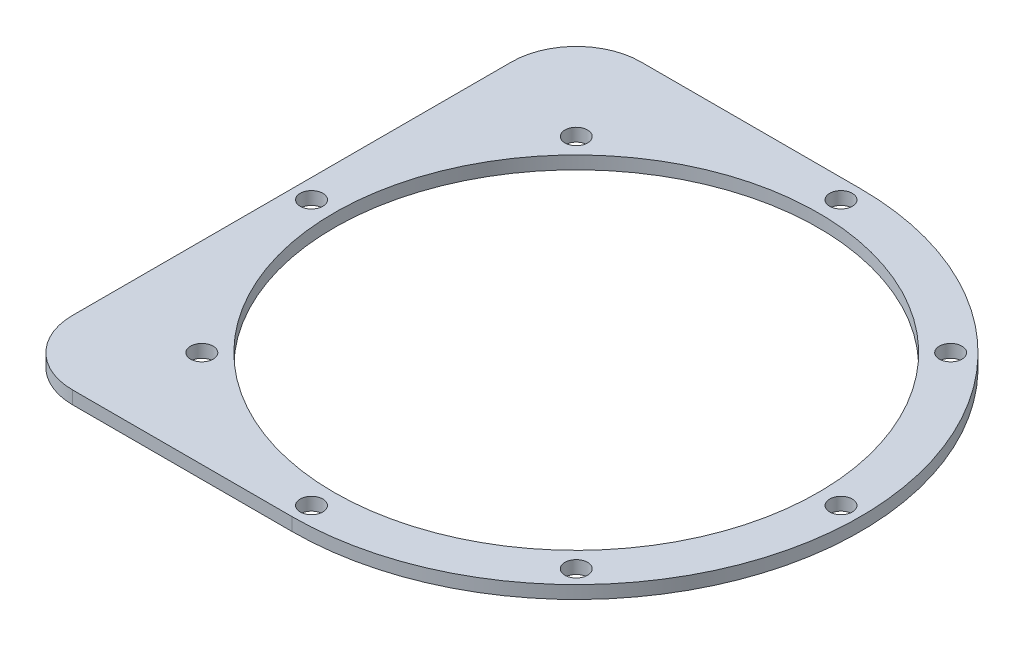
ISO-10303-21;
HEADER;
FILE_DESCRIPTION(('STEP AP214'),'2;1');
FILE_NAME('part.step','',(''),(''),'','','');
FILE_SCHEMA(('AUTOMOTIVE_DESIGN { 1 0 10303 214 1 1 1 1 }'));
ENDSEC;
DATA;
#1=APPLICATION_CONTEXT('core data for automotive mechanical design processes');
#2=APPLICATION_PROTOCOL_DEFINITION('international standard','automotive_design',2000,#1);
#3=PRODUCT_CONTEXT('',#1,'mechanical');
#4=PRODUCT('Part','Part','',(#3));
#5=PRODUCT_RELATED_PRODUCT_CATEGORY('part','',(#4));
#6=PRODUCT_DEFINITION_FORMATION('','',#4);
#7=PRODUCT_DEFINITION_CONTEXT('part definition',#1,'design');
#8=PRODUCT_DEFINITION('design','',#6,#7);
#9=PRODUCT_DEFINITION_SHAPE('','',#8);
#10=(LENGTH_UNIT() NAMED_UNIT(*) SI_UNIT(.MILLI.,.METRE.));
#11=(NAMED_UNIT(*) PLANE_ANGLE_UNIT() SI_UNIT($,.RADIAN.));
#12=(NAMED_UNIT(*) SI_UNIT($,.STERADIAN.) SOLID_ANGLE_UNIT());
#13=UNCERTAINTY_MEASURE_WITH_UNIT(LENGTH_MEASURE(1.E-05),#10,'distance_accuracy_value','');
#14=(GEOMETRIC_REPRESENTATION_CONTEXT(3) GLOBAL_UNCERTAINTY_ASSIGNED_CONTEXT((#13)) GLOBAL_UNIT_ASSIGNED_CONTEXT((#10,
#11,#12)) REPRESENTATION_CONTEXT('',''));
#15=CARTESIAN_POINT('',(0.,0.,0.));
#16=DIRECTION('',(0.,0.,1.));
#17=DIRECTION('',(1.,0.,0.));
#18=AXIS2_PLACEMENT_3D('',#15,#16,#17);
#19=CARTESIAN_POINT('',(0.,2.,0.));
#20=DIRECTION('',(0.,-1.,0.));
#21=DIRECTION('',(0.,0.,-1.));
#22=AXIS2_PLACEMENT_3D('',#19,#20,#21);
#23=CYLINDRICAL_SURFACE('',#22,44.);
#24=CARTESIAN_POINT('',(0.,0.,0.));
#25=DIRECTION('',(0.,1.,0.));
#26=DIRECTION('',(0.,0.,1.));
#27=AXIS2_PLACEMENT_3D('',#24,#25,#26);
#28=CIRCLE('',#27,44.);
#29=CARTESIAN_POINT('',(0.,0.,44.));
#30=VERTEX_POINT('',#29);
#31=CARTESIAN_POINT('',(0.,0.,-44.));
#32=VERTEX_POINT('',#31);
#33=EDGE_CURVE('E92',#30,#32,#28,.T.);
#34=ORIENTED_EDGE('',*,*,#33,.T.);
#35=DIRECTION('',(0.,1.,0.));
#36=VECTOR('',#35,1.);
#37=CARTESIAN_POINT('',(0.,-98.3869910099907,-44.));
#38=LINE('',#37,#36);
#39=CARTESIAN_POINT('',(0.,2.,-44.));
#40=VERTEX_POINT('',#39);
#41=EDGE_CURVE('E106',#32,#40,#38,.T.);
#42=ORIENTED_EDGE('',*,*,#41,.T.);
#43=CARTESIAN_POINT('',(0.,2.,0.));
#44=DIRECTION('',(0.,1.,0.));
#45=DIRECTION('',(0.,0.,1.));
#46=AXIS2_PLACEMENT_3D('',#43,#44,#45);
#47=CIRCLE('',#46,44.);
#48=CARTESIAN_POINT('',(0.,2.,44.));
#49=VERTEX_POINT('',#48);
#50=EDGE_CURVE('E100',#49,#40,#47,.T.);
#51=ORIENTED_EDGE('',*,*,#50,.F.);
#52=DIRECTION('',(0.,1.,0.));
#53=VECTOR('',#52,1.);
#54=CARTESIAN_POINT('',(0.,-98.3869910099907,44.));
#55=LINE('',#54,#53);
#56=EDGE_CURVE('E104',#30,#49,#55,.T.);
#57=ORIENTED_EDGE('',*,*,#56,.F.);
#58=EDGE_LOOP('',(#34,#42,#51,#57));
#59=FACE_BOUND('',#58,.T.);
#60=ADVANCED_FACE('F38',(#59),#23,.T.);
#61=CARTESIAN_POINT('',(0.,2.,0.));
#62=DIRECTION('',(0.,1.,0.));
#63=DIRECTION('',(0.,0.,1.));
#64=AXIS2_PLACEMENT_3D('',#61,#62,#63);
#65=PLANE('',#64);
#66=CARTESIAN_POINT('',(0.,2.,0.));
#67=DIRECTION('',(0.,1.,0.));
#68=DIRECTION('',(0.,0.,1.));
#69=AXIS2_PLACEMENT_3D('',#66,#67,#68);
#70=CIRCLE('',#69,37.5);
#71=CARTESIAN_POINT('',(0.,2.,37.5));
#72=VERTEX_POINT('',#71);
#73=EDGE_CURVE('E194',#72,#72,#70,.T.);
#74=ORIENTED_EDGE('',*,*,#73,.F.);
#75=EDGE_LOOP('',(#74));
#76=FACE_BOUND('',#75,.T.);
#77=CARTESIAN_POINT('',(-1.43150734892568E-13,2.,-41.));
#78=DIRECTION('',(0.,1.,0.));
#79=DIRECTION('',(1.,0.,0.));
#80=AXIS2_PLACEMENT_3D('',#77,#78,#79);
#81=CIRCLE('',#80,1.75);
#82=CARTESIAN_POINT('',(1.74999999999986,2.,-41.));
#83=VERTEX_POINT('',#82);
#84=EDGE_CURVE('E177',#83,#83,#81,.T.);
#85=ORIENTED_EDGE('',*,*,#84,.F.);
#86=EDGE_LOOP('',(#85));
#87=FACE_BOUND('',#86,.T.);
#88=CARTESIAN_POINT('',(-28.9913780286486,2.,-28.9913780286483));
#89=DIRECTION('',(0.,1.,0.));
#90=DIRECTION('',(0.707106781186544,0.,-0.707106781186551));
#91=AXIS2_PLACEMENT_3D('',#88,#89,#90);
#92=CIRCLE('',#91,1.75);
#93=CARTESIAN_POINT('',(-27.7539411615722,2.,-30.2288148957248));
#94=VERTEX_POINT('',#93);
#95=EDGE_CURVE('E171',#94,#94,#92,.T.);
#96=ORIENTED_EDGE('',*,*,#95,.F.);
#97=EDGE_LOOP('',(#96));
#98=FACE_BOUND('',#97,.T.);
#99=CARTESIAN_POINT('',(-41.,2.,0.));
#100=DIRECTION('',(0.,1.,0.));
#101=DIRECTION('',(0.,0.,-1.));
#102=AXIS2_PLACEMENT_3D('',#99,#100,#101);
#103=CIRCLE('',#102,1.75);
#104=CARTESIAN_POINT('',(-41.,2.,-1.75));
#105=VERTEX_POINT('',#104);
#106=EDGE_CURVE('E165',#105,#105,#103,.T.);
#107=ORIENTED_EDGE('',*,*,#106,.F.);
#108=EDGE_LOOP('',(#107));
#109=FACE_BOUND('',#108,.T.);
#110=CARTESIAN_POINT('',(-28.9913780286482,2.,28.9913780286487));
#111=DIRECTION('',(0.,1.,0.));
#112=DIRECTION('',(-0.707106781186554,0.,-0.707106781186541));
#113=AXIS2_PLACEMENT_3D('',#110,#111,#112);
#114=CIRCLE('',#113,1.75);
#115=CARTESIAN_POINT('',(-30.2288148957247,2.,27.7539411615723));
#116=VERTEX_POINT('',#115);
#117=EDGE_CURVE('E158',#116,#116,#114,.T.);
#118=ORIENTED_EDGE('',*,*,#117,.F.);
#119=EDGE_LOOP('',(#118));
#120=FACE_BOUND('',#119,.T.);
#121=CARTESIAN_POINT('',(4.29452204677705E-13,2.,41.));
#122=DIRECTION('',(0.,1.,0.));
#123=DIRECTION('',(-1.,0.,0.));
#124=AXIS2_PLACEMENT_3D('',#121,#122,#123);
#125=CIRCLE('',#124,1.75);
#126=CARTESIAN_POINT('',(-1.74999999999957,2.,41.));
#127=VERTEX_POINT('',#126);
#128=EDGE_CURVE('E189',#127,#127,#125,.T.);
#129=ORIENTED_EDGE('',*,*,#128,.F.);
#130=EDGE_LOOP('',(#129));
#131=FACE_BOUND('',#130,.T.);
#132=CARTESIAN_POINT('',(28.9913780286488,2.,28.9913780286481));
#133=DIRECTION('',(0.,1.,0.));
#134=DIRECTION('',(-0.707106781186539,0.,0.707106781186556));
#135=AXIS2_PLACEMENT_3D('',#132,#133,#134);
#136=CIRCLE('',#135,1.75);
#137=CARTESIAN_POINT('',(27.7539411615724,2.,30.2288148957246));
#138=VERTEX_POINT('',#137);
#139=EDGE_CURVE('E182',#138,#138,#136,.T.);
#140=ORIENTED_EDGE('',*,*,#139,.F.);
#141=EDGE_LOOP('',(#140));
#142=FACE_BOUND('',#141,.T.);
#143=CARTESIAN_POINT('',(28.9913780286484,2.,-28.9913780286485));
#144=DIRECTION('',(0.,1.,0.));
#145=DIRECTION('',(0.707106781186549,0.,0.707106781186546));
#146=AXIS2_PLACEMENT_3D('',#143,#144,#145);
#147=CIRCLE('',#146,1.75);
#148=CARTESIAN_POINT('',(30.2288148957249,2.,-27.753941161572));
#149=VERTEX_POINT('',#148);
#150=EDGE_CURVE('E152',#149,#149,#147,.T.);
#151=ORIENTED_EDGE('',*,*,#150,.F.);
#152=EDGE_LOOP('',(#151));
#153=FACE_BOUND('',#152,.T.);
#154=CARTESIAN_POINT('',(41.,2.,0.));
#155=DIRECTION('',(0.,1.,0.));
#156=DIRECTION('',(0.,0.,1.));
#157=AXIS2_PLACEMENT_3D('',#154,#155,#156);
#158=CIRCLE('',#157,1.75);
#159=CARTESIAN_POINT('',(41.,2.,1.75));
#160=VERTEX_POINT('',#159);
#161=EDGE_CURVE('E146',#160,#160,#158,.T.);
#162=ORIENTED_EDGE('',*,*,#161,.F.);
#163=EDGE_LOOP('',(#162));
#164=FACE_BOUND('',#163,.T.);
#165=DIRECTION('',(0.,0.,1.));
#166=VECTOR('',#165,1.);
#167=CARTESIAN_POINT('',(-44.,2.,44.));
#168=LINE('',#167,#166);
#169=CARTESIAN_POINT('',(-44.,2.,-34.));
#170=VERTEX_POINT('',#169);
#171=CARTESIAN_POINT('',(-44.,2.,34.));
#172=VERTEX_POINT('',#171);
#173=EDGE_CURVE('E138',#170,#172,#168,.T.);
#174=ORIENTED_EDGE('',*,*,#173,.T.);
#175=CARTESIAN_POINT('',(-34.,2.,34.));
#176=DIRECTION('',(0.,1.,0.));
#177=DIRECTION('',(0.,0.,1.));
#178=AXIS2_PLACEMENT_3D('',#175,#176,#177);
#179=CIRCLE('',#178,10.);
#180=CARTESIAN_POINT('',(-34.,2.,44.));
#181=VERTEX_POINT('',#180);
#182=EDGE_CURVE('E123',#172,#181,#179,.T.);
#183=ORIENTED_EDGE('',*,*,#182,.T.);
#184=DIRECTION('',(1.,0.,0.));
#185=VECTOR('',#184,1.);
#186=CARTESIAN_POINT('',(0.,2.,44.));
#187=LINE('',#186,#185);
#188=EDGE_CURVE('E137',#181,#49,#187,.T.);
#189=ORIENTED_EDGE('',*,*,#188,.T.);
#190=ORIENTED_EDGE('',*,*,#50,.T.);
#191=DIRECTION('',(-1.,0.,0.));
#192=VECTOR('',#191,1.);
#193=CARTESIAN_POINT('',(0.,2.,-44.));
#194=LINE('',#193,#192);
#195=CARTESIAN_POINT('',(-34.,2.,-44.));
#196=VERTEX_POINT('',#195);
#197=EDGE_CURVE('E107',#40,#196,#194,.T.);
#198=ORIENTED_EDGE('',*,*,#197,.T.);
#199=CARTESIAN_POINT('',(-34.,2.,-34.));
#200=DIRECTION('',(0.,1.,0.));
#201=DIRECTION('',(0.,0.,1.));
#202=AXIS2_PLACEMENT_3D('',#199,#200,#201);
#203=CIRCLE('',#202,10.);
#204=EDGE_CURVE('E121',#196,#170,#203,.T.);
#205=ORIENTED_EDGE('',*,*,#204,.T.);
#206=EDGE_LOOP('',(#174,#183,#189,#190,#198,#205));
#207=FACE_BOUND('',#206,.T.);
#208=ADVANCED_FACE('F136',(#76,#87,#98,#109,#120,#131,#142,#153,#164,#207),#65,.T.);
#209=CARTESIAN_POINT('',(0.,0.,0.));
#210=DIRECTION('',(0.,1.,0.));
#211=DIRECTION('',(0.,0.,1.));
#212=AXIS2_PLACEMENT_3D('',#209,#210,#211);
#213=PLANE('',#212);
#214=CARTESIAN_POINT('',(0.,0.,0.));
#215=DIRECTION('',(0.,1.,0.));
#216=DIRECTION('',(0.,0.,1.));
#217=AXIS2_PLACEMENT_3D('',#214,#215,#216);
#218=CIRCLE('',#217,37.5);
#219=CARTESIAN_POINT('',(0.,0.,37.5));
#220=VERTEX_POINT('',#219);
#221=EDGE_CURVE('E186',#220,#220,#218,.T.);
#222=ORIENTED_EDGE('',*,*,#221,.T.);
#223=EDGE_LOOP('',(#222));
#224=FACE_BOUND('',#223,.T.);
#225=CARTESIAN_POINT('',(-1.43150734892568E-13,0.,-41.));
#226=DIRECTION('',(0.,1.,0.));
#227=DIRECTION('',(1.,0.,0.));
#228=AXIS2_PLACEMENT_3D('',#225,#226,#227);
#229=CIRCLE('',#228,1.75);
#230=CARTESIAN_POINT('',(1.74999999999986,0.,-41.));
#231=VERTEX_POINT('',#230);
#232=EDGE_CURVE('E155',#231,#231,#229,.T.);
#233=ORIENTED_EDGE('',*,*,#232,.T.);
#234=EDGE_LOOP('',(#233));
#235=FACE_BOUND('',#234,.T.);
#236=CARTESIAN_POINT('',(-28.9913780286486,0.,-28.9913780286483));
#237=DIRECTION('',(0.,1.,0.));
#238=DIRECTION('',(0.707106781186544,0.,-0.707106781186551));
#239=AXIS2_PLACEMENT_3D('',#236,#237,#238);
#240=CIRCLE('',#239,1.75);
#241=CARTESIAN_POINT('',(-27.7539411615722,0.,-30.2288148957248));
#242=VERTEX_POINT('',#241);
#243=EDGE_CURVE('E174',#242,#242,#240,.T.);
#244=ORIENTED_EDGE('',*,*,#243,.T.);
#245=EDGE_LOOP('',(#244));
#246=FACE_BOUND('',#245,.T.);
#247=CARTESIAN_POINT('',(-41.,0.,0.));
#248=DIRECTION('',(0.,1.,0.));
#249=DIRECTION('',(0.,0.,-1.));
#250=AXIS2_PLACEMENT_3D('',#247,#248,#249);
#251=CIRCLE('',#250,1.75);
#252=CARTESIAN_POINT('',(-41.,0.,-1.75));
#253=VERTEX_POINT('',#252);
#254=EDGE_CURVE('E168',#253,#253,#251,.T.);
#255=ORIENTED_EDGE('',*,*,#254,.T.);
#256=EDGE_LOOP('',(#255));
#257=FACE_BOUND('',#256,.T.);
#258=CARTESIAN_POINT('',(-28.9913780286482,0.,28.9913780286487));
#259=DIRECTION('',(0.,1.,0.));
#260=DIRECTION('',(-0.707106781186554,0.,-0.707106781186541));
#261=AXIS2_PLACEMENT_3D('',#258,#259,#260);
#262=CIRCLE('',#261,1.75);
#263=CARTESIAN_POINT('',(-30.2288148957247,0.,27.7539411615723));
#264=VERTEX_POINT('',#263);
#265=EDGE_CURVE('E161',#264,#264,#262,.T.);
#266=ORIENTED_EDGE('',*,*,#265,.T.);
#267=EDGE_LOOP('',(#266));
#268=FACE_BOUND('',#267,.T.);
#269=CARTESIAN_POINT('',(4.29452204677705E-13,0.,41.));
#270=DIRECTION('',(0.,1.,0.));
#271=DIRECTION('',(-1.,0.,0.));
#272=AXIS2_PLACEMENT_3D('',#269,#270,#271);
#273=CIRCLE('',#272,1.75);
#274=CARTESIAN_POINT('',(-1.74999999999957,0.,41.));
#275=VERTEX_POINT('',#274);
#276=EDGE_CURVE('E162',#275,#275,#273,.T.);
#277=ORIENTED_EDGE('',*,*,#276,.T.);
#278=EDGE_LOOP('',(#277));
#279=FACE_BOUND('',#278,.T.);
#280=CARTESIAN_POINT('',(28.9913780286488,0.,28.9913780286481));
#281=DIRECTION('',(0.,1.,0.));
#282=DIRECTION('',(-0.707106781186539,0.,0.707106781186556));
#283=AXIS2_PLACEMENT_3D('',#280,#281,#282);
#284=CIRCLE('',#283,1.75);
#285=CARTESIAN_POINT('',(27.7539411615724,0.,30.2288148957246));
#286=VERTEX_POINT('',#285);
#287=EDGE_CURVE('E185',#286,#286,#284,.T.);
#288=ORIENTED_EDGE('',*,*,#287,.T.);
#289=EDGE_LOOP('',(#288));
#290=FACE_BOUND('',#289,.T.);
#291=CARTESIAN_POINT('',(28.9913780286484,0.,-28.9913780286485));
#292=DIRECTION('',(0.,1.,0.));
#293=DIRECTION('',(0.707106781186549,0.,0.707106781186546));
#294=AXIS2_PLACEMENT_3D('',#291,#292,#293);
#295=CIRCLE('',#294,1.75);
#296=CARTESIAN_POINT('',(30.2288148957249,0.,-27.753941161572));
#297=VERTEX_POINT('',#296);
#298=EDGE_CURVE('E149',#297,#297,#295,.T.);
#299=ORIENTED_EDGE('',*,*,#298,.T.);
#300=EDGE_LOOP('',(#299));
#301=FACE_BOUND('',#300,.T.);
#302=CARTESIAN_POINT('',(41.,0.,0.));
#303=DIRECTION('',(0.,1.,0.));
#304=DIRECTION('',(0.,0.,1.));
#305=AXIS2_PLACEMENT_3D('',#302,#303,#304);
#306=CIRCLE('',#305,1.75);
#307=CARTESIAN_POINT('',(41.,0.,1.75));
#308=VERTEX_POINT('',#307);
#309=EDGE_CURVE('E142',#308,#308,#306,.T.);
#310=ORIENTED_EDGE('',*,*,#309,.T.);
#311=EDGE_LOOP('',(#310));
#312=FACE_BOUND('',#311,.T.);
#313=DIRECTION('',(-1.,0.,0.));
#314=VECTOR('',#313,1.);
#315=CARTESIAN_POINT('',(0.,0.,44.));
#316=LINE('',#315,#314);
#317=CARTESIAN_POINT('',(-34.,0.,44.));
#318=VERTEX_POINT('',#317);
#319=EDGE_CURVE('E95',#30,#318,#316,.T.);
#320=ORIENTED_EDGE('',*,*,#319,.T.);
#321=CARTESIAN_POINT('',(-34.,0.,34.));
#322=DIRECTION('',(0.,1.,0.));
#323=DIRECTION('',(0.,0.,1.));
#324=AXIS2_PLACEMENT_3D('',#321,#322,#323);
#325=CIRCLE('',#324,10.);
#326=CARTESIAN_POINT('',(-44.,0.,34.));
#327=VERTEX_POINT('',#326);
#328=EDGE_CURVE('E46',#318,#327,#325,.F.);
#329=ORIENTED_EDGE('',*,*,#328,.T.);
#330=DIRECTION('',(0.,0.,-1.));
#331=VECTOR('',#330,1.);
#332=CARTESIAN_POINT('',(-44.,0.,44.));
#333=LINE('',#332,#331);
#334=CARTESIAN_POINT('',(-44.,0.,-34.));
#335=VERTEX_POINT('',#334);
#336=EDGE_CURVE('E110',#327,#335,#333,.T.);
#337=ORIENTED_EDGE('',*,*,#336,.T.);
#338=CARTESIAN_POINT('',(-34.,0.,-34.));
#339=DIRECTION('',(0.,1.,0.));
#340=DIRECTION('',(0.,0.,1.));
#341=AXIS2_PLACEMENT_3D('',#338,#339,#340);
#342=CIRCLE('',#341,10.);
#343=CARTESIAN_POINT('',(-34.,0.,-44.));
#344=VERTEX_POINT('',#343);
#345=EDGE_CURVE('E53',#335,#344,#342,.F.);
#346=ORIENTED_EDGE('',*,*,#345,.T.);
#347=DIRECTION('',(1.,0.,0.));
#348=VECTOR('',#347,1.);
#349=CARTESIAN_POINT('',(0.,0.,-44.));
#350=LINE('',#349,#348);
#351=EDGE_CURVE('E97',#344,#32,#350,.T.);
#352=ORIENTED_EDGE('',*,*,#351,.T.);
#353=ORIENTED_EDGE('',*,*,#33,.F.);
#354=EDGE_LOOP('',(#320,#329,#337,#346,#352,#353));
#355=FACE_BOUND('',#354,.T.);
#356=ADVANCED_FACE('F94',(#224,#235,#246,#257,#268,#279,#290,#301,#312,#355),#213,.F.);
#357=CARTESIAN_POINT('',(-44.,-98.3869910099907,44.));
#358=DIRECTION('',(-1.,0.,0.));
#359=DIRECTION('',(0.,0.,1.));
#360=AXIS2_PLACEMENT_3D('',#357,#358,#359);
#361=PLANE('',#360);
#362=ORIENTED_EDGE('',*,*,#336,.F.);
#363=DIRECTION('',(0.,1.,0.));
#364=VECTOR('',#363,1.);
#365=CARTESIAN_POINT('',(-44.,-98.3869910099907,34.));
#366=LINE('',#365,#364);
#367=EDGE_CURVE('E118',#327,#172,#366,.T.);
#368=ORIENTED_EDGE('',*,*,#367,.T.);
#369=ORIENTED_EDGE('',*,*,#173,.F.);
#370=DIRECTION('',(0.,1.,0.));
#371=VECTOR('',#370,1.);
#372=CARTESIAN_POINT('',(-44.,-98.3869910099907,-34.));
#373=LINE('',#372,#371);
#374=EDGE_CURVE('E115',#170,#335,#373,.F.);
#375=ORIENTED_EDGE('',*,*,#374,.T.);
#376=EDGE_LOOP('',(#362,#368,#369,#375));
#377=FACE_BOUND('',#376,.T.);
#378=ADVANCED_FACE('F130',(#377),#361,.T.);
#379=CARTESIAN_POINT('',(0.,-98.3869910099907,-44.));
#380=DIRECTION('',(0.,0.,-1.));
#381=DIRECTION('',(-1.,0.,0.));
#382=AXIS2_PLACEMENT_3D('',#379,#380,#381);
#383=PLANE('',#382);
#384=ORIENTED_EDGE('',*,*,#351,.F.);
#385=DIRECTION('',(0.,1.,0.));
#386=VECTOR('',#385,1.);
#387=CARTESIAN_POINT('',(-34.,-98.3869910099907,-44.));
#388=LINE('',#387,#386);
#389=EDGE_CURVE('E11',#344,#196,#388,.T.);
#390=ORIENTED_EDGE('',*,*,#389,.T.);
#391=ORIENTED_EDGE('',*,*,#197,.F.);
#392=ORIENTED_EDGE('',*,*,#41,.F.);
#393=EDGE_LOOP('',(#384,#390,#391,#392));
#394=FACE_BOUND('',#393,.T.);
#395=ADVANCED_FACE('F240',(#394),#383,.T.);
#396=CARTESIAN_POINT('',(0.,-98.3869910099907,44.));
#397=DIRECTION('',(0.,0.,1.));
#398=DIRECTION('',(1.,0.,0.));
#399=AXIS2_PLACEMENT_3D('',#396,#397,#398);
#400=PLANE('',#399);
#401=ORIENTED_EDGE('',*,*,#188,.F.);
#402=DIRECTION('',(0.,1.,0.));
#403=VECTOR('',#402,1.);
#404=CARTESIAN_POINT('',(-34.,-98.3869910099907,44.));
#405=LINE('',#404,#403);
#406=EDGE_CURVE('E61',#181,#318,#405,.F.);
#407=ORIENTED_EDGE('',*,*,#406,.T.);
#408=ORIENTED_EDGE('',*,*,#319,.F.);
#409=ORIENTED_EDGE('',*,*,#56,.T.);
#410=EDGE_LOOP('',(#401,#407,#408,#409));
#411=FACE_BOUND('',#410,.T.);
#412=ADVANCED_FACE('F109',(#411),#400,.T.);
#413=CARTESIAN_POINT('',(41.,0.,0.));
#414=DIRECTION('',(0.,1.,0.));
#415=DIRECTION('',(0.,0.,1.));
#416=AXIS2_PLACEMENT_3D('',#413,#414,#415);
#417=CYLINDRICAL_SURFACE('',#416,1.75);
#418=ORIENTED_EDGE('',*,*,#309,.F.);
#419=EDGE_LOOP('',(#418));
#420=FACE_BOUND('',#419,.T.);
#421=ORIENTED_EDGE('',*,*,#161,.T.);
#422=EDGE_LOOP('',(#421));
#423=FACE_BOUND('',#422,.T.);
#424=ADVANCED_FACE('F228',(#420,#423),#417,.F.);
#425=CARTESIAN_POINT('',(28.9913780286484,0.,-28.9913780286485));
#426=DIRECTION('',(0.,1.,0.));
#427=DIRECTION('',(0.,0.,1.));
#428=AXIS2_PLACEMENT_3D('',#425,#426,#427);
#429=CYLINDRICAL_SURFACE('',#428,1.75);
#430=ORIENTED_EDGE('',*,*,#298,.F.);
#431=EDGE_LOOP('',(#430));
#432=FACE_BOUND('',#431,.T.);
#433=ORIENTED_EDGE('',*,*,#150,.T.);
#434=EDGE_LOOP('',(#433));
#435=FACE_BOUND('',#434,.T.);
#436=ADVANCED_FACE('F230',(#432,#435),#429,.F.);
#437=CARTESIAN_POINT('',(28.9913780286488,0.,28.9913780286481));
#438=DIRECTION('',(0.,1.,0.));
#439=DIRECTION('',(0.,0.,1.));
#440=AXIS2_PLACEMENT_3D('',#437,#438,#439);
#441=CYLINDRICAL_SURFACE('',#440,1.75);
#442=ORIENTED_EDGE('',*,*,#287,.F.);
#443=EDGE_LOOP('',(#442));
#444=FACE_BOUND('',#443,.T.);
#445=ORIENTED_EDGE('',*,*,#139,.T.);
#446=EDGE_LOOP('',(#445));
#447=FACE_BOUND('',#446,.T.);
#448=ADVANCED_FACE('F237',(#444,#447),#441,.F.);
#449=CARTESIAN_POINT('',(4.29452204677705E-13,0.,41.));
#450=DIRECTION('',(0.,1.,0.));
#451=DIRECTION('',(0.,0.,1.));
#452=AXIS2_PLACEMENT_3D('',#449,#450,#451);
#453=CYLINDRICAL_SURFACE('',#452,1.75);
#454=ORIENTED_EDGE('',*,*,#276,.F.);
#455=EDGE_LOOP('',(#454));
#456=FACE_BOUND('',#455,.T.);
#457=ORIENTED_EDGE('',*,*,#128,.T.);
#458=EDGE_LOOP('',(#457));
#459=FACE_BOUND('',#458,.T.);
#460=ADVANCED_FACE('F325',(#456,#459),#453,.F.);
#461=CARTESIAN_POINT('',(-28.9913780286482,0.,28.9913780286487));
#462=DIRECTION('',(0.,1.,0.));
#463=DIRECTION('',(0.,0.,1.));
#464=AXIS2_PLACEMENT_3D('',#461,#462,#463);
#465=CYLINDRICAL_SURFACE('',#464,1.75);
#466=ORIENTED_EDGE('',*,*,#265,.F.);
#467=EDGE_LOOP('',(#466));
#468=FACE_BOUND('',#467,.T.);
#469=ORIENTED_EDGE('',*,*,#117,.T.);
#470=EDGE_LOOP('',(#469));
#471=FACE_BOUND('',#470,.T.);
#472=ADVANCED_FACE('F314',(#468,#471),#465,.F.);
#473=CARTESIAN_POINT('',(-41.,0.,0.));
#474=DIRECTION('',(0.,1.,0.));
#475=DIRECTION('',(0.,0.,1.));
#476=AXIS2_PLACEMENT_3D('',#473,#474,#475);
#477=CYLINDRICAL_SURFACE('',#476,1.75);
#478=ORIENTED_EDGE('',*,*,#254,.F.);
#479=EDGE_LOOP('',(#478));
#480=FACE_BOUND('',#479,.T.);
#481=ORIENTED_EDGE('',*,*,#106,.T.);
#482=EDGE_LOOP('',(#481));
#483=FACE_BOUND('',#482,.T.);
#484=ADVANCED_FACE('F303',(#480,#483),#477,.F.);
#485=CARTESIAN_POINT('',(-28.9913780286486,0.,-28.9913780286483));
#486=DIRECTION('',(0.,1.,0.));
#487=DIRECTION('',(0.,0.,1.));
#488=AXIS2_PLACEMENT_3D('',#485,#486,#487);
#489=CYLINDRICAL_SURFACE('',#488,1.75);
#490=ORIENTED_EDGE('',*,*,#243,.F.);
#491=EDGE_LOOP('',(#490));
#492=FACE_BOUND('',#491,.T.);
#493=ORIENTED_EDGE('',*,*,#95,.T.);
#494=EDGE_LOOP('',(#493));
#495=FACE_BOUND('',#494,.T.);
#496=ADVANCED_FACE('F292',(#492,#495),#489,.F.);
#497=CARTESIAN_POINT('',(-1.43150734892568E-13,0.,-41.));
#498=DIRECTION('',(0.,1.,0.));
#499=DIRECTION('',(0.,0.,1.));
#500=AXIS2_PLACEMENT_3D('',#497,#498,#499);
#501=CYLINDRICAL_SURFACE('',#500,1.75);
#502=ORIENTED_EDGE('',*,*,#232,.F.);
#503=EDGE_LOOP('',(#502));
#504=FACE_BOUND('',#503,.T.);
#505=ORIENTED_EDGE('',*,*,#84,.T.);
#506=EDGE_LOOP('',(#505));
#507=FACE_BOUND('',#506,.T.);
#508=ADVANCED_FACE('F205',(#504,#507),#501,.F.);
#509=CARTESIAN_POINT('',(0.,0.,0.));
#510=DIRECTION('',(0.,1.,0.));
#511=DIRECTION('',(0.,0.,1.));
#512=AXIS2_PLACEMENT_3D('',#509,#510,#511);
#513=CYLINDRICAL_SURFACE('',#512,37.5);
#514=ORIENTED_EDGE('',*,*,#221,.F.);
#515=EDGE_LOOP('',(#514));
#516=FACE_BOUND('',#515,.T.);
#517=ORIENTED_EDGE('',*,*,#73,.T.);
#518=EDGE_LOOP('',(#517));
#519=FACE_BOUND('',#518,.T.);
#520=ADVANCED_FACE('F202',(#516,#519),#513,.F.);
#521=CARTESIAN_POINT('',(-34.,-98.3869910099907,34.));
#522=DIRECTION('',(0.,1.,0.));
#523=DIRECTION('',(0.,0.,1.));
#524=AXIS2_PLACEMENT_3D('',#521,#522,#523);
#525=CYLINDRICAL_SURFACE('',#524,10.);
#526=ORIENTED_EDGE('',*,*,#328,.F.);
#527=ORIENTED_EDGE('',*,*,#406,.F.);
#528=ORIENTED_EDGE('',*,*,#182,.F.);
#529=ORIENTED_EDGE('',*,*,#367,.F.);
#530=EDGE_LOOP('',(#526,#527,#528,#529));
#531=FACE_BOUND('',#530,.T.);
#532=ADVANCED_FACE('F134',(#531),#525,.T.);
#533=CARTESIAN_POINT('',(-34.,-98.3869910099907,-34.));
#534=DIRECTION('',(0.,1.,0.));
#535=DIRECTION('',(0.,0.,1.));
#536=AXIS2_PLACEMENT_3D('',#533,#534,#535);
#537=CYLINDRICAL_SURFACE('',#536,10.);
#538=ORIENTED_EDGE('',*,*,#345,.F.);
#539=ORIENTED_EDGE('',*,*,#374,.F.);
#540=ORIENTED_EDGE('',*,*,#204,.F.);
#541=ORIENTED_EDGE('',*,*,#389,.F.);
#542=EDGE_LOOP('',(#538,#539,#540,#541));
#543=FACE_BOUND('',#542,.T.);
#544=ADVANCED_FACE('F40',(#543),#537,.T.);
#545=CLOSED_SHELL('',(#60,#208,#356,#378,#395,#412,#424,#436,#448,#460,#472,#484,#496,#508,#520,
#532,#544));
#546=MANIFOLD_SOLID_BREP('B2',#545);
#547=ADVANCED_BREP_SHAPE_REPRESENTATION('',(#18,#546),#14);
#548=SHAPE_DEFINITION_REPRESENTATION(#9,#547);
ENDSEC;
END-ISO-10303-21;
